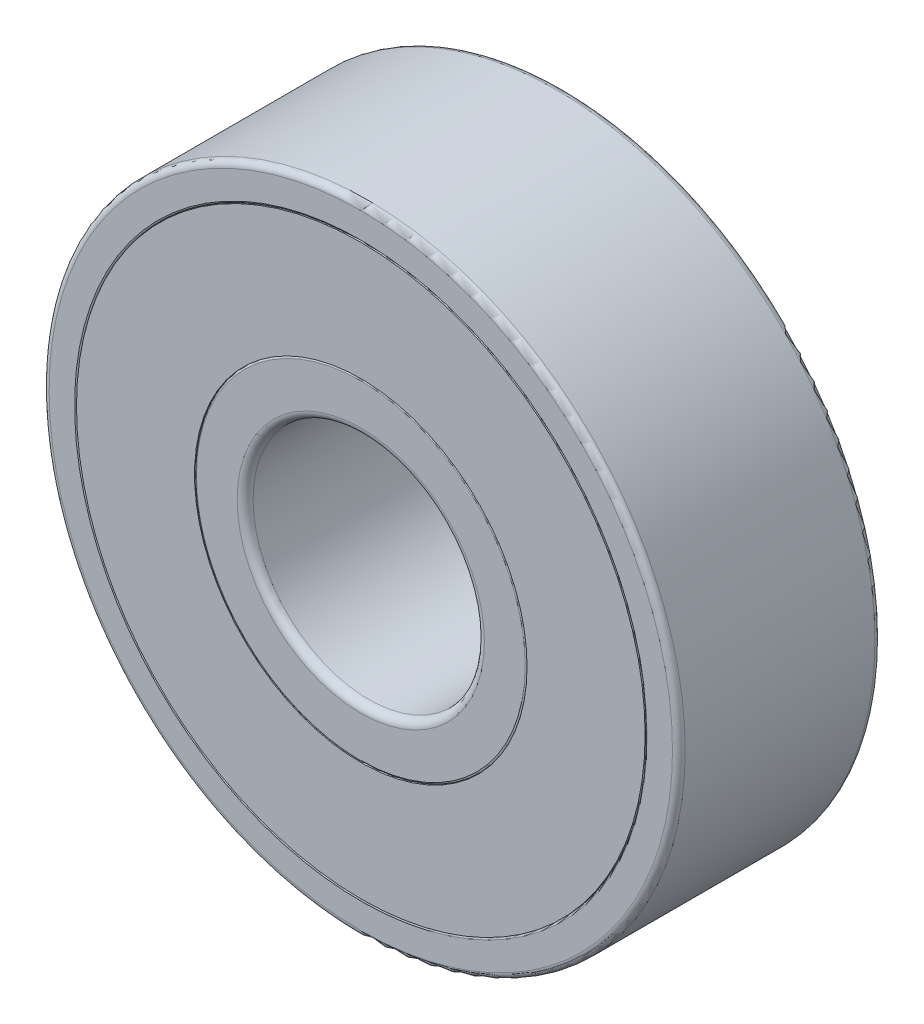
ISO-10303-21;
HEADER;
FILE_DESCRIPTION(('STEP AP214'),'2;1');
FILE_NAME('part.step','',(''),(''),'','','');
FILE_SCHEMA(('AUTOMOTIVE_DESIGN { 1 0 10303 214 1 1 1 1 }'));
ENDSEC;
DATA;
#1=APPLICATION_CONTEXT('core data for automotive mechanical design processes');
#2=APPLICATION_PROTOCOL_DEFINITION('international standard','automotive_design',2000,#1);
#3=PRODUCT_CONTEXT('',#1,'mechanical');
#4=PRODUCT('Part','Part','',(#3));
#5=PRODUCT_RELATED_PRODUCT_CATEGORY('part','',(#4));
#6=PRODUCT_DEFINITION_FORMATION('','',#4);
#7=PRODUCT_DEFINITION_CONTEXT('part definition',#1,'design');
#8=PRODUCT_DEFINITION('design','',#6,#7);
#9=PRODUCT_DEFINITION_SHAPE('','',#8);
#10=(LENGTH_UNIT() NAMED_UNIT(*) SI_UNIT(.MILLI.,.METRE.));
#11=(NAMED_UNIT(*) PLANE_ANGLE_UNIT() SI_UNIT($,.RADIAN.));
#12=(NAMED_UNIT(*) SI_UNIT($,.STERADIAN.) SOLID_ANGLE_UNIT());
#13=UNCERTAINTY_MEASURE_WITH_UNIT(LENGTH_MEASURE(1.E-05),#10,'distance_accuracy_value','');
#14=(GEOMETRIC_REPRESENTATION_CONTEXT(3) GLOBAL_UNCERTAINTY_ASSIGNED_CONTEXT((#13)) GLOBAL_UNIT_ASSIGNED_CONTEXT((#10,
#11,#12)) REPRESENTATION_CONTEXT('',''));
#15=CARTESIAN_POINT('',(0.,0.,0.));
#16=DIRECTION('',(0.,0.,1.));
#17=DIRECTION('',(1.,0.,0.));
#18=AXIS2_PLACEMENT_3D('',#15,#16,#17);
#19=CARTESIAN_POINT('',(0.,0.,3.5));
#20=DIRECTION('',(0.,0.,1.));
#21=DIRECTION('',(1.,0.,0.));
#22=AXIS2_PLACEMENT_3D('',#19,#20,#21);
#23=PLANE('',#22);
#24=CARTESIAN_POINT('',(0.,0.,3.5));
#25=DIRECTION('',(0.,0.,1.));
#26=DIRECTION('',(1.,0.,0.));
#27=AXIS2_PLACEMENT_3D('',#24,#25,#26);
#28=CIRCLE('',#27,9.83333333333333);
#29=CARTESIAN_POINT('',(9.83333333333333,0.,3.5));
#30=VERTEX_POINT('',#29);
#31=EDGE_CURVE('E11',#30,#30,#28,.T.);
#32=ORIENTED_EDGE('',*,*,#31,.T.);
#33=EDGE_LOOP('',(#32));
#34=FACE_BOUND('',#33,.T.);
#35=CARTESIAN_POINT('',(0.,0.,3.5));
#36=DIRECTION('',(0.,0.,1.));
#37=DIRECTION('',(1.,0.,0.));
#38=AXIS2_PLACEMENT_3D('',#35,#36,#37);
#39=CIRCLE('',#38,5.75);
#40=CARTESIAN_POINT('',(5.75,0.,3.5));
#41=VERTEX_POINT('',#40);
#42=EDGE_CURVE('E55',#41,#41,#39,.T.);
#43=ORIENTED_EDGE('',*,*,#42,.F.);
#44=EDGE_LOOP('',(#43));
#45=FACE_BOUND('',#44,.T.);
#46=ADVANCED_FACE('F44',(#34,#45),#23,.T.);
#47=CARTESIAN_POINT('',(0.,0.,-3.5));
#48=DIRECTION('',(0.,0.,1.));
#49=DIRECTION('',(1.,0.,0.));
#50=AXIS2_PLACEMENT_3D('',#47,#48,#49);
#51=PLANE('',#50);
#52=CARTESIAN_POINT('',(0.,0.,-3.5));
#53=DIRECTION('',(0.,0.,1.));
#54=DIRECTION('',(1.,0.,0.));
#55=AXIS2_PLACEMENT_3D('',#52,#53,#54);
#56=CIRCLE('',#55,9.83333333333333);
#57=CARTESIAN_POINT('',(9.83333333333333,0.,-3.5));
#58=VERTEX_POINT('',#57);
#59=EDGE_CURVE('E48',#58,#58,#56,.T.);
#60=ORIENTED_EDGE('',*,*,#59,.F.);
#61=EDGE_LOOP('',(#60));
#62=FACE_BOUND('',#61,.T.);
#63=CARTESIAN_POINT('',(0.,0.,-3.5));
#64=DIRECTION('',(0.,0.,1.));
#65=DIRECTION('',(1.,0.,0.));
#66=AXIS2_PLACEMENT_3D('',#63,#64,#65);
#67=CIRCLE('',#66,5.75);
#68=CARTESIAN_POINT('',(5.75,0.,-3.5));
#69=VERTEX_POINT('',#68);
#70=EDGE_CURVE('E57',#69,#69,#67,.T.);
#71=ORIENTED_EDGE('',*,*,#70,.T.);
#72=EDGE_LOOP('',(#71));
#73=FACE_BOUND('',#72,.T.);
#74=ADVANCED_FACE('F67',(#62,#73),#51,.F.);
#75=CARTESIAN_POINT('',(0.,0.,3.5));
#76=DIRECTION('',(0.,0.,-1.));
#77=DIRECTION('',(-1.,0.,0.));
#78=AXIS2_PLACEMENT_3D('',#75,#76,#77);
#79=CYLINDRICAL_SURFACE('',#78,9.83333333333333);
#80=ORIENTED_EDGE('',*,*,#31,.F.);
#81=EDGE_LOOP('',(#80));
#82=FACE_BOUND('',#81,.T.);
#83=ORIENTED_EDGE('',*,*,#59,.T.);
#84=EDGE_LOOP('',(#83));
#85=FACE_BOUND('',#84,.T.);
#86=ADVANCED_FACE('F46',(#82,#85),#79,.T.);
#87=CARTESIAN_POINT('',(0.,0.,3.5));
#88=DIRECTION('',(0.,0.,-1.));
#89=DIRECTION('',(-1.,0.,0.));
#90=AXIS2_PLACEMENT_3D('',#87,#88,#89);
#91=CYLINDRICAL_SURFACE('',#90,5.75);
#92=ORIENTED_EDGE('',*,*,#42,.T.);
#93=EDGE_LOOP('',(#92));
#94=FACE_BOUND('',#93,.T.);
#95=ORIENTED_EDGE('',*,*,#70,.F.);
#96=EDGE_LOOP('',(#95));
#97=FACE_BOUND('',#96,.T.);
#98=ADVANCED_FACE('F63',(#94,#97),#91,.F.);
#99=CLOSED_SHELL('',(#46,#74,#86,#98));
#100=MANIFOLD_SOLID_BREP('B2',#99);
#101=CARTESIAN_POINT('',(6.09177030089667,-4.85802470614937,0.));
#102=DIRECTION('',(-0.781831482468022,0.623489801858743,0.));
#103=DIRECTION('',(0.,0.,-1.));
#104=AXIS2_PLACEMENT_3D('',#101,#102,#103);
#105=SPHERICAL_SURFACE('',#104,2.45);
#106=CARTESIAN_POINT('',(4.17628316885002,-3.33047469159545,0.));
#107=VERTEX_POINT('',#106);
#108=VERTEX_LOOP('',#107);
#109=FACE_BOUND('',#108,.T.);
#110=ADVANCED_FACE('F112',(#109),#105,.T.);
#111=CLOSED_SHELL('',(#110));
#112=MANIFOLD_SOLID_BREP('B6',#111);
#113=CARTESIAN_POINT('',(7.59631331575006,1.73380894374288,0.));
#114=DIRECTION('',(-0.974927912181826,-0.222520933956305,0.));
#115=DIRECTION('',(0.,0.,-1.));
#116=AXIS2_PLACEMENT_3D('',#113,#114,#115);
#117=SPHERICAL_SURFACE('',#116,2.45);
#118=CARTESIAN_POINT('',(5.20773993090458,1.18863265554993,0.));
#119=VERTEX_POINT('',#118);
#120=VERTEX_LOOP('',#119);
#121=FACE_BOUND('',#120,.T.);
#122=ADVANCED_FACE('F131',(#121),#117,.T.);
#123=CLOSED_SHELL('',(#122));
#124=MANIFOLD_SOLID_BREP('B40',#123);
#125=CARTESIAN_POINT('',(3.38067746729103,7.02004909573965,0.));
#126=DIRECTION('',(-0.433883739117565,-0.900968867902416,0.));
#127=DIRECTION('',(0.,0.,-1.));
#128=AXIS2_PLACEMENT_3D('',#125,#126,#127);
#129=SPHERICAL_SURFACE('',#128,2.45);
#130=CARTESIAN_POINT('',(2.31766230645299,4.81267536937874,0.));
#131=VERTEX_POINT('',#130);
#132=VERTEX_LOOP('',#131);
#133=FACE_BOUND('',#132,.T.);
#134=ADVANCED_FACE('F150',(#133),#129,.T.);
#135=CLOSED_SHELL('',(#134));
#136=MANIFOLD_SOLID_BREP('B108',#135);
#137=CARTESIAN_POINT('',(-3.38067746729093,7.0200490957397,0.));
#138=DIRECTION('',(0.433883739117553,-0.900968867902422,0.));
#139=DIRECTION('',(0.,0.,-1.));
#140=AXIS2_PLACEMENT_3D('',#137,#138,#139);
#141=SPHERICAL_SURFACE('',#140,2.45);
#142=CARTESIAN_POINT('',(-2.31766230645293,4.81267536937877,0.));
#143=VERTEX_POINT('',#142);
#144=VERTEX_LOOP('',#143);
#145=FACE_BOUND('',#144,.T.);
#146=ADVANCED_FACE('F169',(#145),#141,.T.);
#147=CLOSED_SHELL('',(#146));
#148=MANIFOLD_SOLID_BREP('B127',#147);
#149=CARTESIAN_POINT('',(-7.59631331575003,1.73380894374298,0.));
#150=DIRECTION('',(0.974927912181823,-0.222520933956318,0.));
#151=DIRECTION('',(0.,0.,-1.));
#152=AXIS2_PLACEMENT_3D('',#149,#150,#151);
#153=SPHERICAL_SURFACE('',#152,2.45);
#154=CARTESIAN_POINT('',(-5.20773993090457,1.18863265555,0.));
#155=VERTEX_POINT('',#154);
#156=VERTEX_LOOP('',#155);
#157=FACE_BOUND('',#156,.T.);
#158=ADVANCED_FACE('F188',(#157),#153,.T.);
#159=CLOSED_SHELL('',(#158));
#160=MANIFOLD_SOLID_BREP('B146',#159);
#161=CARTESIAN_POINT('',(-6.09177030089674,-4.85802470614929,0.));
#162=DIRECTION('',(0.781831482468031,0.623489801858732,0.));
#163=DIRECTION('',(0.,0.,-1.));
#164=AXIS2_PLACEMENT_3D('',#161,#162,#163);
#165=SPHERICAL_SURFACE('',#164,2.45);
#166=CARTESIAN_POINT('',(-4.17628316885006,-3.33047469159539,0.));
#167=VERTEX_POINT('',#166);
#168=VERTEX_LOOP('',#167);
#169=FACE_BOUND('',#168,.T.);
#170=ADVANCED_FACE('F207',(#169),#165,.T.);
#171=CLOSED_SHELL('',(#170));
#172=MANIFOLD_SOLID_BREP('B165',#171);
#173=CARTESIAN_POINT('',(0.,-7.79166666666667,0.));
#174=DIRECTION('',(0.,1.,0.));
#175=DIRECTION('',(0.,0.,-1.));
#176=AXIS2_PLACEMENT_3D('',#173,#174,#175);
#177=SPHERICAL_SURFACE('',#176,2.45);
#178=CARTESIAN_POINT('',(0.,-5.34166666666667,0.));
#179=VERTEX_POINT('',#178);
#180=VERTEX_LOOP('',#179);
#181=FACE_BOUND('',#180,.T.);
#182=ADVANCED_FACE('F228',(#181),#177,.T.);
#183=CLOSED_SHELL('',(#182));
#184=MANIFOLD_SOLID_BREP('B184',#183);
#185=CARTESIAN_POINT('',(0.,0.,3.5));
#186=DIRECTION('',(0.,0.,1.));
#187=DIRECTION('',(1.,0.,0.));
#188=AXIS2_PLACEMENT_3D('',#185,#186,#187);
#189=CYLINDRICAL_SURFACE('',#188,5.75);
#190=CARTESIAN_POINT('',(0.,0.,3.434));
#191=DIRECTION('',(0.,0.,1.));
#192=DIRECTION('',(1.,0.,0.));
#193=AXIS2_PLACEMENT_3D('',#190,#191,#192);
#194=CIRCLE('',#193,5.75);
#195=CARTESIAN_POINT('',(5.75,0.,3.434));
#196=VERTEX_POINT('',#195);
#197=EDGE_CURVE('E227',#196,#196,#194,.F.);
#198=ORIENTED_EDGE('',*,*,#197,.T.);
#199=EDGE_LOOP('',(#198));
#200=FACE_BOUND('',#199,.T.);
#201=CARTESIAN_POINT('',(0.,0.,1.35428845606179));
#202=DIRECTION('',(0.,0.,-1.));
#203=DIRECTION('',(-1.,0.,0.));
#204=AXIS2_PLACEMENT_3D('',#201,#202,#203);
#205=CIRCLE('',#204,5.75);
#206=CARTESIAN_POINT('',(-5.75,0.,1.35428845606179));
#207=VERTEX_POINT('',#206);
#208=EDGE_CURVE('E280',#207,#207,#205,.T.);
#209=ORIENTED_EDGE('',*,*,#208,.F.);
#210=EDGE_LOOP('',(#209));
#211=FACE_BOUND('',#210,.T.);
#212=ADVANCED_FACE('F248',(#200,#211),#189,.T.);
#213=CARTESIAN_POINT('',(0.,-5.75,3.5));
#214=DIRECTION('',(0.,0.,1.));
#215=DIRECTION('',(1.,0.,0.));
#216=AXIS2_PLACEMENT_3D('',#213,#214,#215);
#217=PLANE('',#216);
#218=CARTESIAN_POINT('',(0.,0.,3.5));
#219=DIRECTION('',(0.,0.,1.));
#220=DIRECTION('',(1.,0.,0.));
#221=AXIS2_PLACEMENT_3D('',#218,#219,#220);
#222=CIRCLE('',#221,5.684);
#223=CARTESIAN_POINT('',(5.684,0.,3.5));
#224=VERTEX_POINT('',#223);
#225=EDGE_CURVE('E255',#224,#224,#222,.T.);
#226=ORIENTED_EDGE('',*,*,#225,.T.);
#227=EDGE_LOOP('',(#226));
#228=FACE_BOUND('',#227,.T.);
#229=CARTESIAN_POINT('',(0.,0.,3.5));
#230=DIRECTION('',(0.,0.,1.));
#231=DIRECTION('',(1.,0.,0.));
#232=AXIS2_PLACEMENT_3D('',#229,#230,#231);
#233=CIRCLE('',#232,4.275);
#234=CARTESIAN_POINT('',(4.275,0.,3.5));
#235=VERTEX_POINT('',#234);
#236=EDGE_CURVE('E268',#235,#235,#233,.F.);
#237=ORIENTED_EDGE('',*,*,#236,.T.);
#238=EDGE_LOOP('',(#237));
#239=FACE_BOUND('',#238,.T.);
#240=ADVANCED_FACE('F305',(#228,#239),#217,.T.);
#241=CARTESIAN_POINT('',(0.,0.,3.5));
#242=DIRECTION('',(0.,0.,1.));
#243=DIRECTION('',(1.,0.,0.));
#244=AXIS2_PLACEMENT_3D('',#241,#242,#243);
#245=CYLINDRICAL_SURFACE('',#244,4.);
#246=CARTESIAN_POINT('',(0.,0.,-3.225));
#247=DIRECTION('',(0.,0.,-1.));
#248=DIRECTION('',(-1.,0.,0.));
#249=AXIS2_PLACEMENT_3D('',#246,#247,#248);
#250=CIRCLE('',#249,4.);
#251=CARTESIAN_POINT('',(-4.,0.,-3.225));
#252=VERTEX_POINT('',#251);
#253=EDGE_CURVE('E271',#252,#252,#250,.T.);
#254=ORIENTED_EDGE('',*,*,#253,.T.);
#255=EDGE_LOOP('',(#254));
#256=FACE_BOUND('',#255,.T.);
#257=CARTESIAN_POINT('',(0.,0.,3.225));
#258=DIRECTION('',(0.,0.,1.));
#259=DIRECTION('',(1.,0.,0.));
#260=AXIS2_PLACEMENT_3D('',#257,#258,#259);
#261=CIRCLE('',#260,4.);
#262=CARTESIAN_POINT('',(4.,0.,3.225));
#263=VERTEX_POINT('',#262);
#264=EDGE_CURVE('E274',#263,#263,#261,.T.);
#265=ORIENTED_EDGE('',*,*,#264,.T.);
#266=EDGE_LOOP('',(#265));
#267=FACE_BOUND('',#266,.T.);
#268=ADVANCED_FACE('F301',(#256,#267),#245,.F.);
#269=CARTESIAN_POINT('',(0.,-5.75,-3.5));
#270=DIRECTION('',(0.,0.,-1.));
#271=DIRECTION('',(-1.,0.,0.));
#272=AXIS2_PLACEMENT_3D('',#269,#270,#271);
#273=PLANE('',#272);
#274=CARTESIAN_POINT('',(0.,0.,-3.5));
#275=DIRECTION('',(0.,0.,-1.));
#276=DIRECTION('',(-1.,0.,0.));
#277=AXIS2_PLACEMENT_3D('',#274,#275,#276);
#278=CIRCLE('',#277,5.684);
#279=CARTESIAN_POINT('',(-5.684,0.,-3.5));
#280=VERTEX_POINT('',#279);
#281=EDGE_CURVE('E259',#280,#280,#278,.T.);
#282=ORIENTED_EDGE('',*,*,#281,.T.);
#283=EDGE_LOOP('',(#282));
#284=FACE_BOUND('',#283,.T.);
#285=CARTESIAN_POINT('',(0.,0.,-3.5));
#286=DIRECTION('',(0.,0.,-1.));
#287=DIRECTION('',(-1.,0.,0.));
#288=AXIS2_PLACEMENT_3D('',#285,#286,#287);
#289=CIRCLE('',#288,4.275);
#290=CARTESIAN_POINT('',(-4.275,0.,-3.5));
#291=VERTEX_POINT('',#290);
#292=EDGE_CURVE('E277',#291,#291,#289,.F.);
#293=ORIENTED_EDGE('',*,*,#292,.T.);
#294=EDGE_LOOP('',(#293));
#295=FACE_BOUND('',#294,.T.);
#296=ADVANCED_FACE('F291',(#284,#295),#273,.T.);
#297=CARTESIAN_POINT('',(0.,0.,-3.434));
#298=DIRECTION('',(0.,0.,-1.));
#299=DIRECTION('',(-1.,0.,0.));
#300=AXIS2_PLACEMENT_3D('',#297,#298,#299);
#301=CIRCLE('',#300,5.75);
#302=CARTESIAN_POINT('',(-5.75,0.,-3.434));
#303=VERTEX_POINT('',#302);
#304=EDGE_CURVE('E263',#303,#303,#301,.F.);
#305=ORIENTED_EDGE('',*,*,#304,.T.);
#306=EDGE_LOOP('',(#305));
#307=FACE_BOUND('',#306,.T.);
#308=CARTESIAN_POINT('',(0.,0.,-1.35428845606179));
#309=DIRECTION('',(0.,0.,1.));
#310=DIRECTION('',(1.,0.,0.));
#311=AXIS2_PLACEMENT_3D('',#308,#309,#310);
#312=CIRCLE('',#311,5.75);
#313=CARTESIAN_POINT('',(5.75,0.,-1.35428845606179));
#314=VERTEX_POINT('',#313);
#315=EDGE_CURVE('E283',#314,#314,#312,.T.);
#316=ORIENTED_EDGE('',*,*,#315,.F.);
#317=EDGE_LOOP('',(#316));
#318=FACE_BOUND('',#317,.T.);
#319=ADVANCED_FACE('F289',(#307,#318),#189,.T.);
#320=CARTESIAN_POINT('',(0.,0.,0.));
#321=DIRECTION('',(0.,0.,1.));
#322=DIRECTION('',(1.,0.,0.));
#323=AXIS2_PLACEMENT_3D('',#320,#321,#322);
#324=TOROIDAL_SURFACE('',#323,7.79166666666667,2.45);
#325=ORIENTED_EDGE('',*,*,#208,.T.);
#326=EDGE_LOOP('',(#325));
#327=FACE_BOUND('',#326,.T.);
#328=ORIENTED_EDGE('',*,*,#315,.T.);
#329=EDGE_LOOP('',(#328));
#330=FACE_BOUND('',#329,.T.);
#331=ADVANCED_FACE('F287',(#327,#330),#324,.F.);
#332=CARTESIAN_POINT('',(0.,0.,-3.225));
#333=DIRECTION('',(0.,0.,-1.));
#334=DIRECTION('',(-1.,0.,0.));
#335=AXIS2_PLACEMENT_3D('',#332,#333,#334);
#336=TOROIDAL_SURFACE('',#335,4.275,0.275);
#337=ORIENTED_EDGE('',*,*,#253,.F.);
#338=EDGE_LOOP('',(#337));
#339=FACE_BOUND('',#338,.T.);
#340=ORIENTED_EDGE('',*,*,#292,.F.);
#341=EDGE_LOOP('',(#340));
#342=FACE_BOUND('',#341,.T.);
#343=ADVANCED_FACE('F298',(#339,#342),#336,.T.);
#344=CARTESIAN_POINT('',(0.,0.,3.225));
#345=DIRECTION('',(0.,0.,1.));
#346=DIRECTION('',(1.,0.,0.));
#347=AXIS2_PLACEMENT_3D('',#344,#345,#346);
#348=TOROIDAL_SURFACE('',#347,4.275,0.275);
#349=ORIENTED_EDGE('',*,*,#236,.F.);
#350=EDGE_LOOP('',(#349));
#351=FACE_BOUND('',#350,.T.);
#352=ORIENTED_EDGE('',*,*,#264,.F.);
#353=EDGE_LOOP('',(#352));
#354=FACE_BOUND('',#353,.T.);
#355=ADVANCED_FACE('F321',(#351,#354),#348,.T.);
#356=CARTESIAN_POINT('',(0.,0.,-3.434));
#357=DIRECTION('',(0.,0.,-1.));
#358=DIRECTION('',(-1.,0.,0.));
#359=AXIS2_PLACEMENT_3D('',#356,#357,#358);
#360=TOROIDAL_SURFACE('',#359,5.684,0.066);
#361=ORIENTED_EDGE('',*,*,#281,.F.);
#362=EDGE_LOOP('',(#361));
#363=FACE_BOUND('',#362,.T.);
#364=ORIENTED_EDGE('',*,*,#304,.F.);
#365=EDGE_LOOP('',(#364));
#366=FACE_BOUND('',#365,.T.);
#367=ADVANCED_FACE('F324',(#363,#366),#360,.T.);
#368=CARTESIAN_POINT('',(0.,0.,3.434));
#369=DIRECTION('',(0.,0.,1.));
#370=DIRECTION('',(1.,0.,0.));
#371=AXIS2_PLACEMENT_3D('',#368,#369,#370);
#372=TOROIDAL_SURFACE('',#371,5.684,0.066);
#373=ORIENTED_EDGE('',*,*,#197,.F.);
#374=EDGE_LOOP('',(#373));
#375=FACE_BOUND('',#374,.T.);
#376=ORIENTED_EDGE('',*,*,#225,.F.);
#377=EDGE_LOOP('',(#376));
#378=FACE_BOUND('',#377,.T.);
#379=ADVANCED_FACE('F250',(#375,#378),#372,.T.);
#380=CLOSED_SHELL('',(#212,#240,#268,#296,#319,#331,#343,#355,#367,#379));
#381=MANIFOLD_SOLID_BREP('B203',#380);
#382=CARTESIAN_POINT('',(0.,0.,3.5));
#383=DIRECTION('',(0.,0.,1.));
#384=DIRECTION('',(1.,0.,0.));
#385=AXIS2_PLACEMENT_3D('',#382,#383,#384);
#386=CYLINDRICAL_SURFACE('',#385,9.83333333333333);
#387=CARTESIAN_POINT('',(0.,0.,3.434));
#388=DIRECTION('',(0.,0.,1.));
#389=DIRECTION('',(1.,0.,0.));
#390=AXIS2_PLACEMENT_3D('',#387,#388,#389);
#391=CIRCLE('',#390,9.83333333333333);
#392=CARTESIAN_POINT('',(9.83333333333333,0.,3.434));
#393=VERTEX_POINT('',#392);
#394=EDGE_CURVE('E406',#393,#393,#391,.T.);
#395=ORIENTED_EDGE('',*,*,#394,.T.);
#396=EDGE_LOOP('',(#395));
#397=FACE_BOUND('',#396,.T.);
#398=CARTESIAN_POINT('',(0.,0.,1.35428845606179));
#399=DIRECTION('',(0.,0.,-1.));
#400=DIRECTION('',(-1.,0.,0.));
#401=AXIS2_PLACEMENT_3D('',#398,#399,#400);
#402=CIRCLE('',#401,9.83333333333333);
#403=CARTESIAN_POINT('',(-9.83333333333333,0.,1.35428845606179));
#404=VERTEX_POINT('',#403);
#405=EDGE_CURVE('E431',#404,#404,#402,.F.);
#406=ORIENTED_EDGE('',*,*,#405,.F.);
#407=EDGE_LOOP('',(#406));
#408=FACE_BOUND('',#407,.T.);
#409=ADVANCED_FACE('F399',(#397,#408),#386,.F.);
#410=CARTESIAN_POINT('',(0.,-9.83333333333333,3.5));
#411=DIRECTION('',(0.,0.,1.));
#412=DIRECTION('',(1.,0.,0.));
#413=AXIS2_PLACEMENT_3D('',#410,#411,#412);
#414=PLANE('',#413);
#415=CARTESIAN_POINT('',(0.,0.,3.5));
#416=DIRECTION('',(0.,0.,1.));
#417=DIRECTION('',(1.,0.,0.));
#418=AXIS2_PLACEMENT_3D('',#415,#416,#417);
#419=CIRCLE('',#418,9.89933333333333);
#420=CARTESIAN_POINT('',(9.89933333333333,0.,3.5));
#421=VERTEX_POINT('',#420);
#422=EDGE_CURVE('E247',#421,#421,#419,.F.);
#423=ORIENTED_EDGE('',*,*,#422,.T.);
#424=EDGE_LOOP('',(#423));
#425=FACE_BOUND('',#424,.T.);
#426=CARTESIAN_POINT('',(0.,0.,3.5));
#427=DIRECTION('',(0.,0.,1.));
#428=DIRECTION('',(1.,0.,0.));
#429=AXIS2_PLACEMENT_3D('',#426,#427,#428);
#430=CIRCLE('',#429,10.78);
#431=CARTESIAN_POINT('',(10.78,0.,3.5));
#432=VERTEX_POINT('',#431);
#433=EDGE_CURVE('E419',#432,#432,#430,.T.);
#434=ORIENTED_EDGE('',*,*,#433,.T.);
#435=EDGE_LOOP('',(#434));
#436=FACE_BOUND('',#435,.T.);
#437=ADVANCED_FACE('F456',(#425,#436),#414,.T.);
#438=CARTESIAN_POINT('',(0.,0.,3.5));
#439=DIRECTION('',(0.,0.,1.));
#440=DIRECTION('',(1.,0.,0.));
#441=AXIS2_PLACEMENT_3D('',#438,#439,#440);
#442=CYLINDRICAL_SURFACE('',#441,11.);
#443=CARTESIAN_POINT('',(0.,0.,-3.28));
#444=DIRECTION('',(0.,0.,-1.));
#445=DIRECTION('',(-1.,0.,0.));
#446=AXIS2_PLACEMENT_3D('',#443,#444,#445);
#447=CIRCLE('',#446,11.);
#448=CARTESIAN_POINT('',(-11.,0.,-3.28));
#449=VERTEX_POINT('',#448);
#450=EDGE_CURVE('E425',#449,#449,#447,.F.);
#451=ORIENTED_EDGE('',*,*,#450,.T.);
#452=EDGE_LOOP('',(#451));
#453=FACE_BOUND('',#452,.T.);
#454=CARTESIAN_POINT('',(0.,0.,3.28));
#455=DIRECTION('',(0.,0.,1.));
#456=DIRECTION('',(1.,0.,0.));
#457=AXIS2_PLACEMENT_3D('',#454,#455,#456);
#458=CIRCLE('',#457,11.);
#459=CARTESIAN_POINT('',(11.,0.,3.28));
#460=VERTEX_POINT('',#459);
#461=EDGE_CURVE('E428',#460,#460,#458,.F.);
#462=ORIENTED_EDGE('',*,*,#461,.T.);
#463=EDGE_LOOP('',(#462));
#464=FACE_BOUND('',#463,.T.);
#465=ADVANCED_FACE('F452',(#453,#464),#442,.T.);
#466=CARTESIAN_POINT('',(0.,-11.,-3.5));
#467=DIRECTION('',(0.,0.,-1.));
#468=DIRECTION('',(-1.,0.,0.));
#469=AXIS2_PLACEMENT_3D('',#466,#467,#468);
#470=PLANE('',#469);
#471=CARTESIAN_POINT('',(0.,0.,-3.5));
#472=DIRECTION('',(0.,0.,-1.));
#473=DIRECTION('',(-1.,0.,0.));
#474=AXIS2_PLACEMENT_3D('',#471,#472,#473);
#475=CIRCLE('',#474,9.89933333333333);
#476=CARTESIAN_POINT('',(-9.89933333333333,0.,-3.5));
#477=VERTEX_POINT('',#476);
#478=EDGE_CURVE('E414',#477,#477,#475,.F.);
#479=ORIENTED_EDGE('',*,*,#478,.T.);
#480=EDGE_LOOP('',(#479));
#481=FACE_BOUND('',#480,.T.);
#482=CARTESIAN_POINT('',(0.,0.,-3.5));
#483=DIRECTION('',(0.,0.,-1.));
#484=DIRECTION('',(-1.,0.,0.));
#485=AXIS2_PLACEMENT_3D('',#482,#483,#484);
#486=CIRCLE('',#485,10.78);
#487=CARTESIAN_POINT('',(-10.78,0.,-3.5));
#488=VERTEX_POINT('',#487);
#489=EDGE_CURVE('E422',#488,#488,#486,.T.);
#490=ORIENTED_EDGE('',*,*,#489,.T.);
#491=EDGE_LOOP('',(#490));
#492=FACE_BOUND('',#491,.T.);
#493=ADVANCED_FACE('F442',(#481,#492),#470,.T.);
#494=CARTESIAN_POINT('',(0.,0.,-3.434));
#495=DIRECTION('',(0.,0.,-1.));
#496=DIRECTION('',(-1.,0.,0.));
#497=AXIS2_PLACEMENT_3D('',#494,#495,#496);
#498=CIRCLE('',#497,9.83333333333333);
#499=CARTESIAN_POINT('',(-9.83333333333333,0.,-3.434));
#500=VERTEX_POINT('',#499);
#501=EDGE_CURVE('E410',#500,#500,#498,.T.);
#502=ORIENTED_EDGE('',*,*,#501,.T.);
#503=EDGE_LOOP('',(#502));
#504=FACE_BOUND('',#503,.T.);
#505=CARTESIAN_POINT('',(0.,0.,-1.35428845606179));
#506=DIRECTION('',(0.,0.,1.));
#507=DIRECTION('',(1.,0.,0.));
#508=AXIS2_PLACEMENT_3D('',#505,#506,#507);
#509=CIRCLE('',#508,9.83333333333333);
#510=CARTESIAN_POINT('',(9.83333333333333,0.,-1.35428845606179));
#511=VERTEX_POINT('',#510);
#512=EDGE_CURVE('E434',#511,#511,#509,.F.);
#513=ORIENTED_EDGE('',*,*,#512,.F.);
#514=EDGE_LOOP('',(#513));
#515=FACE_BOUND('',#514,.T.);
#516=ADVANCED_FACE('F440',(#504,#515),#386,.F.);
#517=CARTESIAN_POINT('',(0.,0.,0.));
#518=DIRECTION('',(0.,0.,1.));
#519=DIRECTION('',(1.,0.,0.));
#520=AXIS2_PLACEMENT_3D('',#517,#518,#519);
#521=TOROIDAL_SURFACE('',#520,7.79166666666667,2.45);
#522=ORIENTED_EDGE('',*,*,#405,.T.);
#523=EDGE_LOOP('',(#522));
#524=FACE_BOUND('',#523,.T.);
#525=ORIENTED_EDGE('',*,*,#512,.T.);
#526=EDGE_LOOP('',(#525));
#527=FACE_BOUND('',#526,.T.);
#528=ADVANCED_FACE('F438',(#524,#527),#521,.F.);
#529=CARTESIAN_POINT('',(0.,0.,-3.28));
#530=DIRECTION('',(0.,0.,-1.));
#531=DIRECTION('',(-1.,0.,0.));
#532=AXIS2_PLACEMENT_3D('',#529,#530,#531);
#533=TOROIDAL_SURFACE('',#532,10.78,0.22);
#534=ORIENTED_EDGE('',*,*,#489,.F.);
#535=EDGE_LOOP('',(#534));
#536=FACE_BOUND('',#535,.T.);
#537=ORIENTED_EDGE('',*,*,#450,.F.);
#538=EDGE_LOOP('',(#537));
#539=FACE_BOUND('',#538,.T.);
#540=ADVANCED_FACE('F449',(#536,#539),#533,.T.);
#541=CARTESIAN_POINT('',(0.,0.,3.28));
#542=DIRECTION('',(0.,0.,1.));
#543=DIRECTION('',(1.,0.,0.));
#544=AXIS2_PLACEMENT_3D('',#541,#542,#543);
#545=TOROIDAL_SURFACE('',#544,10.78,0.22);
#546=ORIENTED_EDGE('',*,*,#461,.F.);
#547=EDGE_LOOP('',(#546));
#548=FACE_BOUND('',#547,.T.);
#549=ORIENTED_EDGE('',*,*,#433,.F.);
#550=EDGE_LOOP('',(#549));
#551=FACE_BOUND('',#550,.T.);
#552=ADVANCED_FACE('F472',(#548,#551),#545,.T.);
#553=CARTESIAN_POINT('',(0.,0.,-3.434));
#554=DIRECTION('',(0.,0.,-1.));
#555=DIRECTION('',(-1.,0.,0.));
#556=AXIS2_PLACEMENT_3D('',#553,#554,#555);
#557=TOROIDAL_SURFACE('',#556,9.89933333333333,0.066);
#558=ORIENTED_EDGE('',*,*,#501,.F.);
#559=EDGE_LOOP('',(#558));
#560=FACE_BOUND('',#559,.T.);
#561=ORIENTED_EDGE('',*,*,#478,.F.);
#562=EDGE_LOOP('',(#561));
#563=FACE_BOUND('',#562,.T.);
#564=ADVANCED_FACE('F475',(#560,#563),#557,.T.);
#565=CARTESIAN_POINT('',(0.,0.,3.434));
#566=DIRECTION('',(0.,0.,1.));
#567=DIRECTION('',(1.,0.,0.));
#568=AXIS2_PLACEMENT_3D('',#565,#566,#567);
#569=TOROIDAL_SURFACE('',#568,9.89933333333333,0.066);
#570=ORIENTED_EDGE('',*,*,#422,.F.);
#571=EDGE_LOOP('',(#570));
#572=FACE_BOUND('',#571,.T.);
#573=ORIENTED_EDGE('',*,*,#394,.F.);
#574=EDGE_LOOP('',(#573));
#575=FACE_BOUND('',#574,.T.);
#576=ADVANCED_FACE('F401',(#572,#575),#569,.T.);
#577=CLOSED_SHELL('',(#409,#437,#465,#493,#516,#528,#540,#552,#564,#576));
#578=MANIFOLD_SOLID_BREP('B222',#577);
#579=ADVANCED_BREP_SHAPE_REPRESENTATION('',(#18,#100,#112,#124,#136,#148,#160,#172,#184,#381,
#578),#14);
#580=SHAPE_DEFINITION_REPRESENTATION(#9,#579);
ENDSEC;
END-ISO-10303-21;
